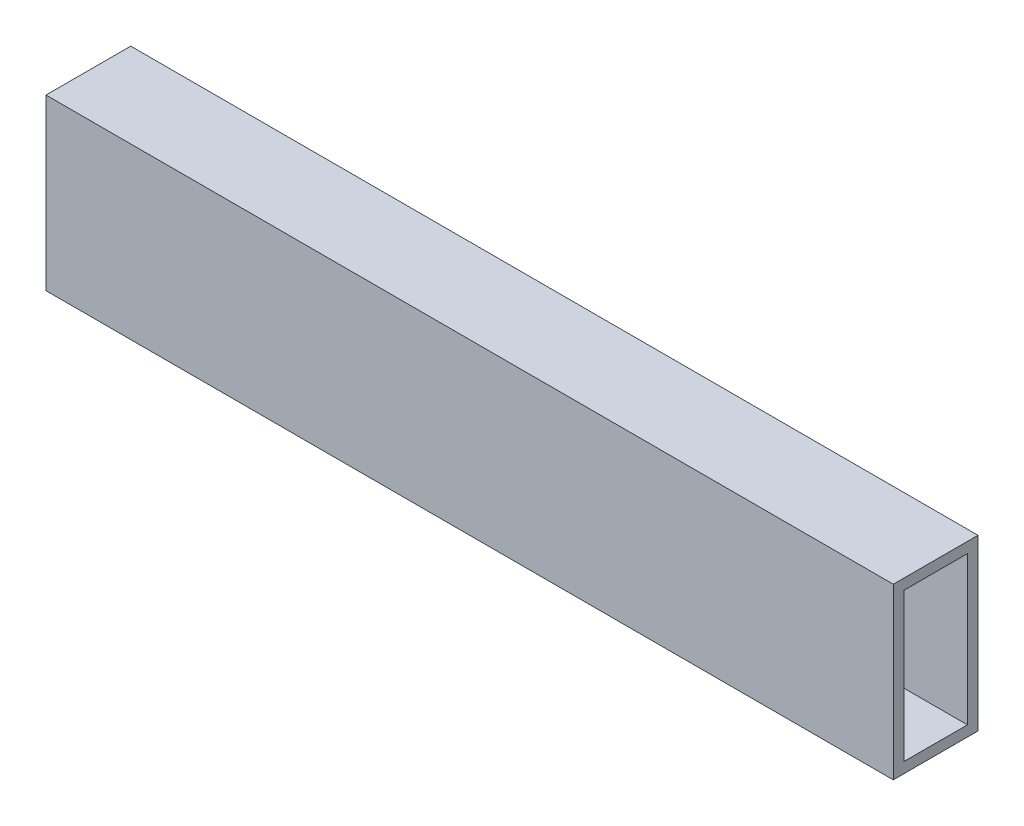
ISO-10303-21;
HEADER;
FILE_DESCRIPTION(('STEP AP214'),'2;1');
FILE_NAME('part.step','',(''),(''),'','','');
FILE_SCHEMA(('AUTOMOTIVE_DESIGN { 1 0 10303 214 1 1 1 1 }'));
ENDSEC;
DATA;
#1=APPLICATION_CONTEXT('core data for automotive mechanical design processes');
#2=APPLICATION_PROTOCOL_DEFINITION('international standard','automotive_design',2000,#1);
#3=PRODUCT_CONTEXT('',#1,'mechanical');
#4=PRODUCT('Part','Part','',(#3));
#5=PRODUCT_RELATED_PRODUCT_CATEGORY('part','',(#4));
#6=PRODUCT_DEFINITION_FORMATION('','',#4);
#7=PRODUCT_DEFINITION_CONTEXT('part definition',#1,'design');
#8=PRODUCT_DEFINITION('design','',#6,#7);
#9=PRODUCT_DEFINITION_SHAPE('','',#8);
#10=(LENGTH_UNIT() NAMED_UNIT(*) SI_UNIT(.MILLI.,.METRE.));
#11=(NAMED_UNIT(*) PLANE_ANGLE_UNIT() SI_UNIT($,.RADIAN.));
#12=(NAMED_UNIT(*) SI_UNIT($,.STERADIAN.) SOLID_ANGLE_UNIT());
#13=UNCERTAINTY_MEASURE_WITH_UNIT(LENGTH_MEASURE(1.E-05),#10,'distance_accuracy_value','');
#14=(GEOMETRIC_REPRESENTATION_CONTEXT(3) GLOBAL_UNCERTAINTY_ASSIGNED_CONTEXT((#13)) GLOBAL_UNIT_ASSIGNED_CONTEXT((#10,
#11,#12)) REPRESENTATION_CONTEXT('',''));
#15=CARTESIAN_POINT('',(0.,0.,0.));
#16=DIRECTION('',(0.,0.,1.));
#17=DIRECTION('',(1.,0.,0.));
#18=AXIS2_PLACEMENT_3D('',#15,#16,#17);
#19=CARTESIAN_POINT('',(254.,0.,0.));
#20=DIRECTION('',(-1.,0.,0.));
#21=DIRECTION('',(0.,0.,1.));
#22=AXIS2_PLACEMENT_3D('',#19,#20,#21);
#23=PLANE('',#22);
#24=DIRECTION('',(0.,-1.,0.));
#25=VECTOR('',#24,1.);
#26=CARTESIAN_POINT('',(254.,0.,0.));
#27=LINE('',#26,#25);
#28=CARTESIAN_POINT('',(254.,50.8,0.));
#29=VERTEX_POINT('',#28);
#30=CARTESIAN_POINT('',(254.,0.,0.));
#31=VERTEX_POINT('',#30);
#32=EDGE_CURVE('E134',#29,#31,#27,.T.);
#33=ORIENTED_EDGE('',*,*,#32,.T.);
#34=DIRECTION('',(0.,0.,-1.));
#35=VECTOR('',#34,1.);
#36=CARTESIAN_POINT('',(254.,0.,0.));
#37=LINE('',#36,#35);
#38=CARTESIAN_POINT('',(254.,0.,-25.4));
#39=VERTEX_POINT('',#38);
#40=EDGE_CURVE('E137',#31,#39,#37,.T.);
#41=ORIENTED_EDGE('',*,*,#40,.T.);
#42=DIRECTION('',(0.,1.,0.));
#43=VECTOR('',#42,1.);
#44=CARTESIAN_POINT('',(254.,0.,-25.4));
#45=LINE('',#44,#43);
#46=CARTESIAN_POINT('',(254.,50.8,-25.4));
#47=VERTEX_POINT('',#46);
#48=EDGE_CURVE('E140',#39,#47,#45,.T.);
#49=ORIENTED_EDGE('',*,*,#48,.T.);
#50=DIRECTION('',(0.,0.,1.));
#51=VECTOR('',#50,1.);
#52=CARTESIAN_POINT('',(254.,50.8,0.));
#53=LINE('',#52,#51);
#54=EDGE_CURVE('E142',#47,#29,#53,.T.);
#55=ORIENTED_EDGE('',*,*,#54,.T.);
#56=EDGE_LOOP('',(#33,#41,#49,#55));
#57=FACE_BOUND('',#56,.T.);
#58=DIRECTION('',(0.,-1.,0.));
#59=VECTOR('',#58,1.);
#60=CARTESIAN_POINT('',(254.,47.625,-3.175));
#61=LINE('',#60,#59);
#62=CARTESIAN_POINT('',(254.,47.625,-3.175));
#63=VERTEX_POINT('',#62);
#64=CARTESIAN_POINT('',(254.,3.175,-3.175));
#65=VERTEX_POINT('',#64);
#66=EDGE_CURVE('E98',#63,#65,#61,.T.);
#67=ORIENTED_EDGE('',*,*,#66,.F.);
#68=DIRECTION('',(0.,0.,1.));
#69=VECTOR('',#68,1.);
#70=CARTESIAN_POINT('',(254.,47.625,-3.175));
#71=LINE('',#70,#69);
#72=CARTESIAN_POINT('',(254.,47.625,-22.225));
#73=VERTEX_POINT('',#72);
#74=EDGE_CURVE('E120',#73,#63,#71,.T.);
#75=ORIENTED_EDGE('',*,*,#74,.F.);
#76=DIRECTION('',(0.,1.,0.));
#77=VECTOR('',#76,1.);
#78=CARTESIAN_POINT('',(254.,47.625,-22.225));
#79=LINE('',#78,#77);
#80=CARTESIAN_POINT('',(254.,3.175,-22.225));
#81=VERTEX_POINT('',#80);
#82=EDGE_CURVE('E118',#81,#73,#79,.T.);
#83=ORIENTED_EDGE('',*,*,#82,.F.);
#84=DIRECTION('',(0.,0.,-1.));
#85=VECTOR('',#84,1.);
#86=CARTESIAN_POINT('',(254.,3.175,-3.175));
#87=LINE('',#86,#85);
#88=EDGE_CURVE('E106',#65,#81,#87,.T.);
#89=ORIENTED_EDGE('',*,*,#88,.F.);
#90=EDGE_LOOP('',(#67,#75,#83,#89));
#91=FACE_BOUND('',#90,.T.);
#92=ADVANCED_FACE('F33',(#57,#91),#23,.F.);
#93=CARTESIAN_POINT('',(0.,0.,0.));
#94=DIRECTION('',(-1.,0.,0.));
#95=DIRECTION('',(0.,0.,1.));
#96=AXIS2_PLACEMENT_3D('',#93,#94,#95);
#97=PLANE('',#96);
#98=DIRECTION('',(0.,-1.,0.));
#99=VECTOR('',#98,1.);
#100=CARTESIAN_POINT('',(0.,0.,0.));
#101=LINE('',#100,#99);
#102=CARTESIAN_POINT('',(0.,50.8,0.));
#103=VERTEX_POINT('',#102);
#104=CARTESIAN_POINT('',(0.,0.,0.));
#105=VERTEX_POINT('',#104);
#106=EDGE_CURVE('E114',#103,#105,#101,.T.);
#107=ORIENTED_EDGE('',*,*,#106,.F.);
#108=DIRECTION('',(0.,0.,1.));
#109=VECTOR('',#108,1.);
#110=CARTESIAN_POINT('',(0.,50.8,0.));
#111=LINE('',#110,#109);
#112=CARTESIAN_POINT('',(0.,50.8,-25.4));
#113=VERTEX_POINT('',#112);
#114=EDGE_CURVE('E138',#113,#103,#111,.T.);
#115=ORIENTED_EDGE('',*,*,#114,.F.);
#116=DIRECTION('',(0.,1.,0.));
#117=VECTOR('',#116,1.);
#118=CARTESIAN_POINT('',(0.,0.,-25.4));
#119=LINE('',#118,#117);
#120=CARTESIAN_POINT('',(0.,0.,-25.4));
#121=VERTEX_POINT('',#120);
#122=EDGE_CURVE('E149',#121,#113,#119,.T.);
#123=ORIENTED_EDGE('',*,*,#122,.F.);
#124=DIRECTION('',(0.,0.,-1.));
#125=VECTOR('',#124,1.);
#126=CARTESIAN_POINT('',(0.,0.,0.));
#127=LINE('',#126,#125);
#128=EDGE_CURVE('E147',#105,#121,#127,.T.);
#129=ORIENTED_EDGE('',*,*,#128,.F.);
#130=EDGE_LOOP('',(#107,#115,#123,#129));
#131=FACE_BOUND('',#130,.T.);
#132=DIRECTION('',(0.,0.,1.));
#133=VECTOR('',#132,1.);
#134=CARTESIAN_POINT('',(0.,47.625,-3.175));
#135=LINE('',#134,#133);
#136=CARTESIAN_POINT('',(0.,47.625,-22.225));
#137=VERTEX_POINT('',#136);
#138=CARTESIAN_POINT('',(0.,47.625,-3.175));
#139=VERTEX_POINT('',#138);
#140=EDGE_CURVE('E107',#137,#139,#135,.T.);
#141=ORIENTED_EDGE('',*,*,#140,.T.);
#142=DIRECTION('',(0.,-1.,0.));
#143=VECTOR('',#142,1.);
#144=CARTESIAN_POINT('',(0.,47.625,-3.175));
#145=LINE('',#144,#143);
#146=CARTESIAN_POINT('',(0.,3.175,-3.175));
#147=VERTEX_POINT('',#146);
#148=EDGE_CURVE('E56',#139,#147,#145,.T.);
#149=ORIENTED_EDGE('',*,*,#148,.T.);
#150=DIRECTION('',(0.,0.,-1.));
#151=VECTOR('',#150,1.);
#152=CARTESIAN_POINT('',(0.,3.175,-3.175));
#153=LINE('',#152,#151);
#154=CARTESIAN_POINT('',(0.,3.175,-22.225));
#155=VERTEX_POINT('',#154);
#156=EDGE_CURVE('E113',#147,#155,#153,.T.);
#157=ORIENTED_EDGE('',*,*,#156,.T.);
#158=DIRECTION('',(0.,1.,0.));
#159=VECTOR('',#158,1.);
#160=CARTESIAN_POINT('',(0.,47.625,-22.225));
#161=LINE('',#160,#159);
#162=EDGE_CURVE('E126',#155,#137,#161,.T.);
#163=ORIENTED_EDGE('',*,*,#162,.T.);
#164=EDGE_LOOP('',(#141,#149,#157,#163));
#165=FACE_BOUND('',#164,.T.);
#166=ADVANCED_FACE('F167',(#131,#165),#97,.T.);
#167=CARTESIAN_POINT('',(254.,0.,0.));
#168=DIRECTION('',(0.,0.,-1.));
#169=DIRECTION('',(-1.,0.,0.));
#170=AXIS2_PLACEMENT_3D('',#167,#168,#169);
#171=PLANE('',#170);
#172=ORIENTED_EDGE('',*,*,#106,.T.);
#173=DIRECTION('',(-1.,0.,0.));
#174=VECTOR('',#173,1.);
#175=CARTESIAN_POINT('',(254.,0.,0.));
#176=LINE('',#175,#174);
#177=EDGE_CURVE('E11',#31,#105,#176,.T.);
#178=ORIENTED_EDGE('',*,*,#177,.F.);
#179=ORIENTED_EDGE('',*,*,#32,.F.);
#180=DIRECTION('',(-1.,0.,0.));
#181=VECTOR('',#180,1.);
#182=CARTESIAN_POINT('',(254.,50.8,0.));
#183=LINE('',#182,#181);
#184=EDGE_CURVE('E144',#29,#103,#183,.T.);
#185=ORIENTED_EDGE('',*,*,#184,.T.);
#186=EDGE_LOOP('',(#172,#178,#179,#185));
#187=FACE_BOUND('',#186,.T.);
#188=ADVANCED_FACE('F35',(#187),#171,.F.);
#189=CARTESIAN_POINT('',(254.,0.,0.));
#190=DIRECTION('',(0.,1.,0.));
#191=DIRECTION('',(0.,0.,1.));
#192=AXIS2_PLACEMENT_3D('',#189,#190,#191);
#193=PLANE('',#192);
#194=ORIENTED_EDGE('',*,*,#128,.T.);
#195=DIRECTION('',(-1.,0.,0.));
#196=VECTOR('',#195,1.);
#197=CARTESIAN_POINT('',(254.,0.,-25.4));
#198=LINE('',#197,#196);
#199=EDGE_CURVE('E41',#39,#121,#198,.T.);
#200=ORIENTED_EDGE('',*,*,#199,.F.);
#201=ORIENTED_EDGE('',*,*,#40,.F.);
#202=ORIENTED_EDGE('',*,*,#177,.T.);
#203=EDGE_LOOP('',(#194,#200,#201,#202));
#204=FACE_BOUND('',#203,.T.);
#205=ADVANCED_FACE('F177',(#204),#193,.F.);
#206=CARTESIAN_POINT('',(254.,0.,-25.4));
#207=DIRECTION('',(0.,0.,1.));
#208=DIRECTION('',(1.,0.,0.));
#209=AXIS2_PLACEMENT_3D('',#206,#207,#208);
#210=PLANE('',#209);
#211=ORIENTED_EDGE('',*,*,#122,.T.);
#212=DIRECTION('',(-1.,0.,0.));
#213=VECTOR('',#212,1.);
#214=CARTESIAN_POINT('',(254.,50.8,-25.4));
#215=LINE('',#214,#213);
#216=EDGE_CURVE('E154',#47,#113,#215,.T.);
#217=ORIENTED_EDGE('',*,*,#216,.F.);
#218=ORIENTED_EDGE('',*,*,#48,.F.);
#219=ORIENTED_EDGE('',*,*,#199,.T.);
#220=EDGE_LOOP('',(#211,#217,#218,#219));
#221=FACE_BOUND('',#220,.T.);
#222=ADVANCED_FACE('F161',(#221),#210,.F.);
#223=CARTESIAN_POINT('',(254.,50.8,0.));
#224=DIRECTION('',(0.,-1.,0.));
#225=DIRECTION('',(0.,0.,-1.));
#226=AXIS2_PLACEMENT_3D('',#223,#224,#225);
#227=PLANE('',#226);
#228=ORIENTED_EDGE('',*,*,#114,.T.);
#229=ORIENTED_EDGE('',*,*,#184,.F.);
#230=ORIENTED_EDGE('',*,*,#54,.F.);
#231=ORIENTED_EDGE('',*,*,#216,.T.);
#232=EDGE_LOOP('',(#228,#229,#230,#231));
#233=FACE_BOUND('',#232,.T.);
#234=ADVANCED_FACE('F171',(#233),#227,.F.);
#235=CARTESIAN_POINT('',(254.,47.625,-3.175));
#236=DIRECTION('',(0.,0.,-1.));
#237=DIRECTION('',(0.,1.,0.));
#238=AXIS2_PLACEMENT_3D('',#235,#236,#237);
#239=PLANE('',#238);
#240=ORIENTED_EDGE('',*,*,#148,.F.);
#241=DIRECTION('',(-1.,0.,0.));
#242=VECTOR('',#241,1.);
#243=CARTESIAN_POINT('',(254.,47.625,-3.175));
#244=LINE('',#243,#242);
#245=EDGE_CURVE('E102',#63,#139,#244,.T.);
#246=ORIENTED_EDGE('',*,*,#245,.F.);
#247=ORIENTED_EDGE('',*,*,#66,.T.);
#248=DIRECTION('',(-1.,0.,0.));
#249=VECTOR('',#248,1.);
#250=CARTESIAN_POINT('',(254.,3.175,-3.175));
#251=LINE('',#250,#249);
#252=EDGE_CURVE('E101',#65,#147,#251,.T.);
#253=ORIENTED_EDGE('',*,*,#252,.T.);
#254=EDGE_LOOP('',(#240,#246,#247,#253));
#255=FACE_BOUND('',#254,.T.);
#256=ADVANCED_FACE('F100',(#255),#239,.T.);
#257=CARTESIAN_POINT('',(254.,3.175,-3.175));
#258=DIRECTION('',(0.,1.,0.));
#259=DIRECTION('',(0.,0.,1.));
#260=AXIS2_PLACEMENT_3D('',#257,#258,#259);
#261=PLANE('',#260);
#262=ORIENTED_EDGE('',*,*,#156,.F.);
#263=ORIENTED_EDGE('',*,*,#252,.F.);
#264=ORIENTED_EDGE('',*,*,#88,.T.);
#265=DIRECTION('',(-1.,0.,0.));
#266=VECTOR('',#265,1.);
#267=CARTESIAN_POINT('',(254.,3.175,-22.225));
#268=LINE('',#267,#266);
#269=EDGE_CURVE('E115',#81,#155,#268,.T.);
#270=ORIENTED_EDGE('',*,*,#269,.T.);
#271=EDGE_LOOP('',(#262,#263,#264,#270));
#272=FACE_BOUND('',#271,.T.);
#273=ADVANCED_FACE('F110',(#272),#261,.T.);
#274=CARTESIAN_POINT('',(254.,47.625,-22.225));
#275=DIRECTION('',(0.,0.,1.));
#276=DIRECTION('',(0.,-1.,0.));
#277=AXIS2_PLACEMENT_3D('',#274,#275,#276);
#278=PLANE('',#277);
#279=ORIENTED_EDGE('',*,*,#162,.F.);
#280=ORIENTED_EDGE('',*,*,#269,.F.);
#281=ORIENTED_EDGE('',*,*,#82,.T.);
#282=DIRECTION('',(-1.,0.,0.));
#283=VECTOR('',#282,1.);
#284=CARTESIAN_POINT('',(254.,47.625,-22.225));
#285=LINE('',#284,#283);
#286=EDGE_CURVE('E48',#73,#137,#285,.T.);
#287=ORIENTED_EDGE('',*,*,#286,.T.);
#288=EDGE_LOOP('',(#279,#280,#281,#287));
#289=FACE_BOUND('',#288,.T.);
#290=ADVANCED_FACE('F200',(#289),#278,.T.);
#291=CARTESIAN_POINT('',(254.,47.625,-3.175));
#292=DIRECTION('',(0.,-1.,0.));
#293=DIRECTION('',(0.,0.,-1.));
#294=AXIS2_PLACEMENT_3D('',#291,#292,#293);
#295=PLANE('',#294);
#296=ORIENTED_EDGE('',*,*,#140,.F.);
#297=ORIENTED_EDGE('',*,*,#286,.F.);
#298=ORIENTED_EDGE('',*,*,#74,.T.);
#299=ORIENTED_EDGE('',*,*,#245,.T.);
#300=EDGE_LOOP('',(#296,#297,#298,#299));
#301=FACE_BOUND('',#300,.T.);
#302=ADVANCED_FACE('F204',(#301),#295,.T.);
#303=CLOSED_SHELL('',(#92,#166,#188,#205,#222,#234,#256,#273,#290,#302));
#304=MANIFOLD_SOLID_BREP('B2',#303);
#305=ADVANCED_BREP_SHAPE_REPRESENTATION('',(#18,#304),#14);
#306=SHAPE_DEFINITION_REPRESENTATION(#9,#305);
ENDSEC;
END-ISO-10303-21;
